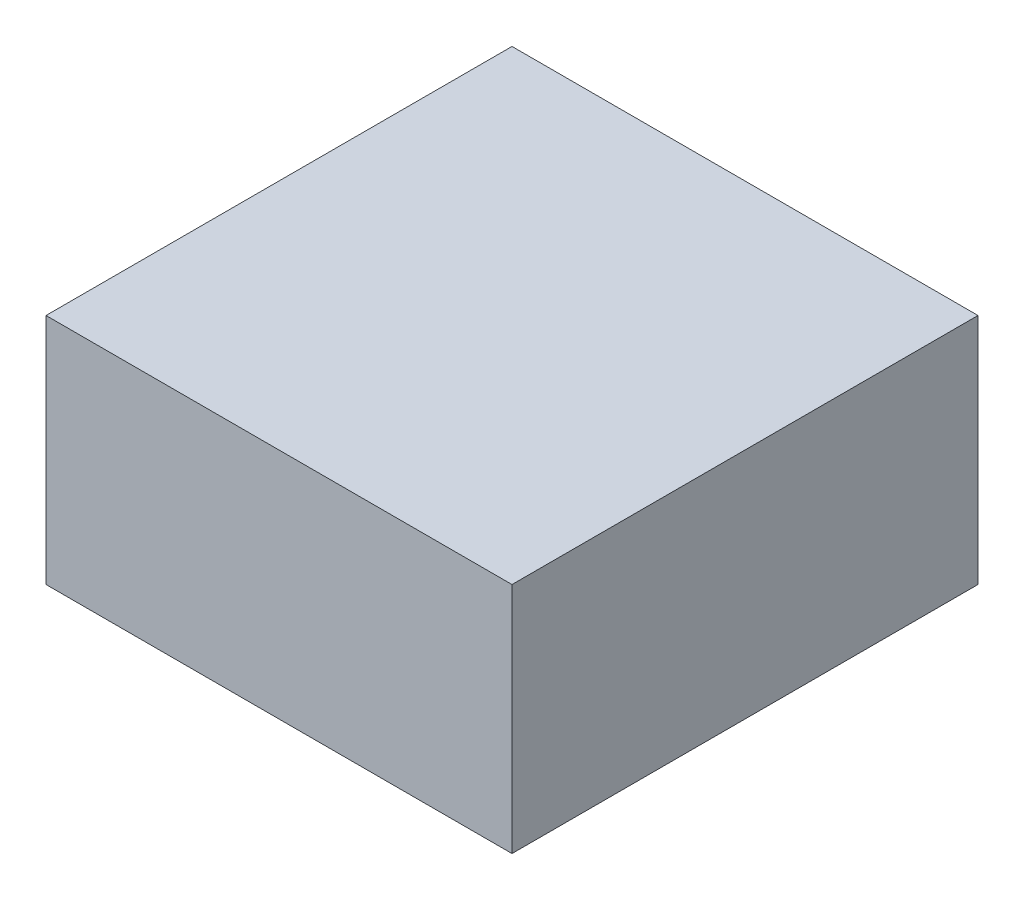
ISO-10303-21;
HEADER;
FILE_DESCRIPTION(('STEP AP214'),'2;1');
FILE_NAME('part.step','',(''),(''),'','','');
FILE_SCHEMA(('AUTOMOTIVE_DESIGN { 1 0 10303 214 1 1 1 1 }'));
ENDSEC;
DATA;
#1=APPLICATION_CONTEXT('core data for automotive mechanical design processes');
#2=APPLICATION_PROTOCOL_DEFINITION('international standard','automotive_design',2000,#1);
#3=PRODUCT_CONTEXT('',#1,'mechanical');
#4=PRODUCT('Part','Part','',(#3));
#5=PRODUCT_RELATED_PRODUCT_CATEGORY('part','',(#4));
#6=PRODUCT_DEFINITION_FORMATION('','',#4);
#7=PRODUCT_DEFINITION_CONTEXT('part definition',#1,'design');
#8=PRODUCT_DEFINITION('design','',#6,#7);
#9=PRODUCT_DEFINITION_SHAPE('','',#8);
#10=(LENGTH_UNIT() NAMED_UNIT(*) SI_UNIT(.MILLI.,.METRE.));
#11=(NAMED_UNIT(*) PLANE_ANGLE_UNIT() SI_UNIT($,.RADIAN.));
#12=(NAMED_UNIT(*) SI_UNIT($,.STERADIAN.) SOLID_ANGLE_UNIT());
#13=UNCERTAINTY_MEASURE_WITH_UNIT(LENGTH_MEASURE(1.E-05),#10,'distance_accuracy_value','');
#14=(GEOMETRIC_REPRESENTATION_CONTEXT(3) GLOBAL_UNCERTAINTY_ASSIGNED_CONTEXT((#13)) GLOBAL_UNIT_ASSIGNED_CONTEXT((#10,
#11,#12)) REPRESENTATION_CONTEXT('',''));
#15=CARTESIAN_POINT('',(0.,0.,0.));
#16=DIRECTION('',(0.,0.,1.));
#17=DIRECTION('',(1.,0.,0.));
#18=AXIS2_PLACEMENT_3D('',#15,#16,#17);
#19=CARTESIAN_POINT('',(-182.562007996033,127.,-123.264705882353));
#20=DIRECTION('',(1.,0.,0.));
#21=DIRECTION('',(0.,0.,-1.));
#22=AXIS2_PLACEMENT_3D('',#19,#20,#21);
#23=PLANE('',#22);
#24=DIRECTION('',(0.,0.,1.));
#25=VECTOR('',#24,1.);
#26=CARTESIAN_POINT('',(-182.562007996033,0.,-123.264705882353));
#27=LINE('',#26,#25);
#28=CARTESIAN_POINT('',(-182.562007996033,0.,-123.264705882353));
#29=VERTEX_POINT('',#28);
#30=CARTESIAN_POINT('',(-182.562007996033,0.,130.735294117647));
#31=VERTEX_POINT('',#30);
#32=EDGE_CURVE('E106',#29,#31,#27,.T.);
#33=ORIENTED_EDGE('',*,*,#32,.T.);
#34=DIRECTION('',(0.,-1.,0.));
#35=VECTOR('',#34,1.);
#36=CARTESIAN_POINT('',(-182.562007996033,127.,130.735294117647));
#37=LINE('',#36,#35);
#38=CARTESIAN_POINT('',(-182.562007996033,127.,130.735294117647));
#39=VERTEX_POINT('',#38);
#40=EDGE_CURVE('E11',#39,#31,#37,.T.);
#41=ORIENTED_EDGE('',*,*,#40,.F.);
#42=DIRECTION('',(0.,0.,1.));
#43=VECTOR('',#42,1.);
#44=CARTESIAN_POINT('',(-182.562007996033,127.,-123.264705882353));
#45=LINE('',#44,#43);
#46=CARTESIAN_POINT('',(-182.562007996033,127.,-123.264705882353));
#47=VERTEX_POINT('',#46);
#48=EDGE_CURVE('E94',#47,#39,#45,.T.);
#49=ORIENTED_EDGE('',*,*,#48,.F.);
#50=DIRECTION('',(0.,-1.,0.));
#51=VECTOR('',#50,1.);
#52=CARTESIAN_POINT('',(-182.562007996033,127.,-123.264705882353));
#53=LINE('',#52,#51);
#54=EDGE_CURVE('E102',#47,#29,#53,.T.);
#55=ORIENTED_EDGE('',*,*,#54,.T.);
#56=EDGE_LOOP('',(#33,#41,#49,#55));
#57=FACE_BOUND('',#56,.T.);
#58=ADVANCED_FACE('F43',(#57),#23,.F.);
#59=CARTESIAN_POINT('',(-182.562007996033,127.,130.735294117647));
#60=DIRECTION('',(0.,0.,-1.));
#61=DIRECTION('',(-1.,0.,0.));
#62=AXIS2_PLACEMENT_3D('',#59,#60,#61);
#63=PLANE('',#62);
#64=DIRECTION('',(1.,0.,0.));
#65=VECTOR('',#64,1.);
#66=CARTESIAN_POINT('',(-182.562007996033,0.,130.735294117647));
#67=LINE('',#66,#65);
#68=CARTESIAN_POINT('',(71.4379920039669,0.,130.735294117647));
#69=VERTEX_POINT('',#68);
#70=EDGE_CURVE('E98',#31,#69,#67,.T.);
#71=ORIENTED_EDGE('',*,*,#70,.T.);
#72=DIRECTION('',(0.,-1.,0.));
#73=VECTOR('',#72,1.);
#74=CARTESIAN_POINT('',(71.4379920039669,127.,130.735294117647));
#75=LINE('',#74,#73);
#76=CARTESIAN_POINT('',(71.4379920039669,127.,130.735294117647));
#77=VERTEX_POINT('',#76);
#78=EDGE_CURVE('E51',#77,#69,#75,.T.);
#79=ORIENTED_EDGE('',*,*,#78,.F.);
#80=DIRECTION('',(1.,0.,0.));
#81=VECTOR('',#80,1.);
#82=CARTESIAN_POINT('',(-182.562007996033,127.,130.735294117647));
#83=LINE('',#82,#81);
#84=EDGE_CURVE('E89',#39,#77,#83,.T.);
#85=ORIENTED_EDGE('',*,*,#84,.F.);
#86=ORIENTED_EDGE('',*,*,#40,.T.);
#87=EDGE_LOOP('',(#71,#79,#85,#86));
#88=FACE_BOUND('',#87,.T.);
#89=ADVANCED_FACE('F97',(#88),#63,.F.);
#90=CARTESIAN_POINT('',(71.4379920039668,127.,-123.264705882353));
#91=DIRECTION('',(-1.,0.,0.));
#92=DIRECTION('',(0.,0.,1.));
#93=AXIS2_PLACEMENT_3D('',#90,#91,#92);
#94=PLANE('',#93);
#95=DIRECTION('',(0.,0.,-1.));
#96=VECTOR('',#95,1.);
#97=CARTESIAN_POINT('',(71.4379920039668,0.,-123.264705882353));
#98=LINE('',#97,#96);
#99=CARTESIAN_POINT('',(71.4379920039668,0.,-123.264705882353));
#100=VERTEX_POINT('',#99);
#101=EDGE_CURVE('E76',#69,#100,#98,.T.);
#102=ORIENTED_EDGE('',*,*,#101,.T.);
#103=DIRECTION('',(0.,-1.,0.));
#104=VECTOR('',#103,1.);
#105=CARTESIAN_POINT('',(71.4379920039668,127.,-123.264705882353));
#106=LINE('',#105,#104);
#107=CARTESIAN_POINT('',(71.4379920039668,127.,-123.264705882353));
#108=VERTEX_POINT('',#107);
#109=EDGE_CURVE('E99',#108,#100,#106,.T.);
#110=ORIENTED_EDGE('',*,*,#109,.F.);
#111=DIRECTION('',(0.,0.,-1.));
#112=VECTOR('',#111,1.);
#113=CARTESIAN_POINT('',(71.4379920039668,127.,-123.264705882353));
#114=LINE('',#113,#112);
#115=EDGE_CURVE('E92',#77,#108,#114,.T.);
#116=ORIENTED_EDGE('',*,*,#115,.F.);
#117=ORIENTED_EDGE('',*,*,#78,.T.);
#118=EDGE_LOOP('',(#102,#110,#116,#117));
#119=FACE_BOUND('',#118,.T.);
#120=ADVANCED_FACE('F100',(#119),#94,.F.);
#121=CARTESIAN_POINT('',(-182.562007996033,127.,-123.264705882353));
#122=DIRECTION('',(0.,0.,1.));
#123=DIRECTION('',(1.,0.,0.));
#124=AXIS2_PLACEMENT_3D('',#121,#122,#123);
#125=PLANE('',#124);
#126=DIRECTION('',(-1.,0.,0.));
#127=VECTOR('',#126,1.);
#128=CARTESIAN_POINT('',(-182.562007996033,0.,-123.264705882353));
#129=LINE('',#128,#127);
#130=EDGE_CURVE('E82',#100,#29,#129,.T.);
#131=ORIENTED_EDGE('',*,*,#130,.T.);
#132=ORIENTED_EDGE('',*,*,#54,.F.);
#133=DIRECTION('',(-1.,0.,0.));
#134=VECTOR('',#133,1.);
#135=CARTESIAN_POINT('',(-182.562007996033,127.,-123.264705882353));
#136=LINE('',#135,#134);
#137=EDGE_CURVE('E59',#108,#47,#136,.T.);
#138=ORIENTED_EDGE('',*,*,#137,.F.);
#139=ORIENTED_EDGE('',*,*,#109,.T.);
#140=EDGE_LOOP('',(#131,#132,#138,#139));
#141=FACE_BOUND('',#140,.T.);
#142=ADVANCED_FACE('F113',(#141),#125,.F.);
#143=CARTESIAN_POINT('',(0.,127.,0.));
#144=DIRECTION('',(0.,1.,0.));
#145=DIRECTION('',(0.,0.,1.));
#146=AXIS2_PLACEMENT_3D('',#143,#144,#145);
#147=PLANE('',#146);
#148=ORIENTED_EDGE('',*,*,#48,.T.);
#149=ORIENTED_EDGE('',*,*,#84,.T.);
#150=ORIENTED_EDGE('',*,*,#115,.T.);
#151=ORIENTED_EDGE('',*,*,#137,.T.);
#152=EDGE_LOOP('',(#148,#149,#150,#151));
#153=FACE_BOUND('',#152,.T.);
#154=ADVANCED_FACE('F90',(#153),#147,.T.);
#155=CARTESIAN_POINT('',(0.,0.,0.));
#156=DIRECTION('',(0.,1.,0.));
#157=DIRECTION('',(0.,0.,1.));
#158=AXIS2_PLACEMENT_3D('',#155,#156,#157);
#159=PLANE('',#158);
#160=ORIENTED_EDGE('',*,*,#32,.F.);
#161=ORIENTED_EDGE('',*,*,#130,.F.);
#162=ORIENTED_EDGE('',*,*,#101,.F.);
#163=ORIENTED_EDGE('',*,*,#70,.F.);
#164=EDGE_LOOP('',(#160,#161,#162,#163));
#165=FACE_BOUND('',#164,.T.);
#166=ADVANCED_FACE('F116',(#165),#159,.F.);
#167=CLOSED_SHELL('',(#58,#89,#120,#142,#154,#166));
#168=MANIFOLD_SOLID_BREP('B2',#167);
#169=ADVANCED_BREP_SHAPE_REPRESENTATION('',(#18,#168),#14);
#170=SHAPE_DEFINITION_REPRESENTATION(#9,#169);
ENDSEC;
END-ISO-10303-21;
